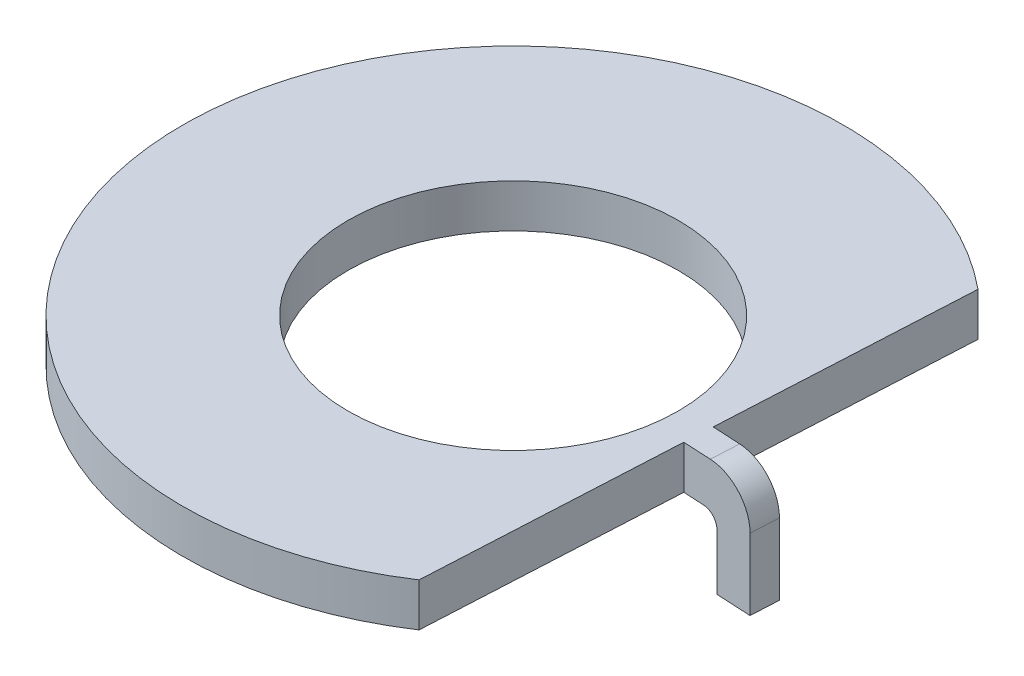
ISO-10303-21;
HEADER;
FILE_DESCRIPTION(('STEP AP214'),'2;1');
FILE_NAME('part.step','',(''),(''),'','','');
FILE_SCHEMA(('AUTOMOTIVE_DESIGN { 1 0 10303 214 1 1 1 1 }'));
ENDSEC;
DATA;
#1=APPLICATION_CONTEXT('core data for automotive mechanical design processes');
#2=APPLICATION_PROTOCOL_DEFINITION('international standard','automotive_design',2000,#1);
#3=PRODUCT_CONTEXT('',#1,'mechanical');
#4=PRODUCT('Part','Part','',(#3));
#5=PRODUCT_RELATED_PRODUCT_CATEGORY('part','',(#4));
#6=PRODUCT_DEFINITION_FORMATION('','',#4);
#7=PRODUCT_DEFINITION_CONTEXT('part definition',#1,'design');
#8=PRODUCT_DEFINITION('design','',#6,#7);
#9=PRODUCT_DEFINITION_SHAPE('','',#8);
#10=(LENGTH_UNIT() NAMED_UNIT(*) SI_UNIT(.MILLI.,.METRE.));
#11=(NAMED_UNIT(*) PLANE_ANGLE_UNIT() SI_UNIT($,.RADIAN.));
#12=(NAMED_UNIT(*) SI_UNIT($,.STERADIAN.) SOLID_ANGLE_UNIT());
#13=UNCERTAINTY_MEASURE_WITH_UNIT(LENGTH_MEASURE(1.E-05),#10,'distance_accuracy_value','');
#14=(GEOMETRIC_REPRESENTATION_CONTEXT(3) GLOBAL_UNCERTAINTY_ASSIGNED_CONTEXT((#13)) GLOBAL_UNIT_ASSIGNED_CONTEXT((#10,
#11,#12)) REPRESENTATION_CONTEXT('',''));
#15=CARTESIAN_POINT('',(0.,0.,0.));
#16=DIRECTION('',(0.,0.,1.));
#17=DIRECTION('',(1.,0.,0.));
#18=AXIS2_PLACEMENT_3D('',#15,#16,#17);
#19=CARTESIAN_POINT('',(3.29856729412844,0.7874,5.00522578572697));
#20=DIRECTION('',(-0.998629534754574,0.,-0.0523359562429439));
#21=DIRECTION('',(-0.0523359562429439,0.,0.998629534754574));
#22=AXIS2_PLACEMENT_3D('',#19,#20,#21);
#23=PLANE('',#22);
#24=DIRECTION('',(0.,1.,0.));
#25=VECTOR('',#24,1.);
#26=CARTESIAN_POINT('',(3.53783329270156,0.,0.43975856222757));
#27=LINE('',#26,#25);
#28=CARTESIAN_POINT('',(3.53783329270156,0.,0.43975856222757));
#29=VERTEX_POINT('',#28);
#30=CARTESIAN_POINT('',(3.53783329270156,0.7874,0.43975856222757));
#31=VERTEX_POINT('',#30);
#32=EDGE_CURVE('E39',#29,#31,#27,.T.);
#33=ORIENTED_EDGE('',*,*,#32,.T.);
#34=DIRECTION('',(0.0523359562429439,0.,-0.998629534754574));
#35=VECTOR('',#34,1.);
#36=CARTESIAN_POINT('',(3.29856729412844,0.7874,5.00522578572697));
#37=LINE('',#36,#35);
#38=CARTESIAN_POINT('',(3.29856729412844,0.7874,5.00522578572697));
#39=VERTEX_POINT('',#38);
#40=EDGE_CURVE('E128',#39,#31,#37,.T.);
#41=ORIENTED_EDGE('',*,*,#40,.F.);
#42=DIRECTION('',(0.,-1.,0.));
#43=VECTOR('',#42,1.);
#44=CARTESIAN_POINT('',(3.29856729412844,0.7874,5.00522578572697));
#45=LINE('',#44,#43);
#46=CARTESIAN_POINT('',(3.29856729412844,0.,5.00522578572697));
#47=VERTEX_POINT('',#46);
#48=EDGE_CURVE('E24',#39,#47,#45,.T.);
#49=ORIENTED_EDGE('',*,*,#48,.T.);
#50=DIRECTION('',(0.0523359562429439,0.,-0.998629534754574));
#51=VECTOR('',#50,1.);
#52=CARTESIAN_POINT('',(3.29856729412844,0.,5.00522578572697));
#53=LINE('',#52,#51);
#54=EDGE_CURVE('E122',#47,#29,#53,.T.);
#55=ORIENTED_EDGE('',*,*,#54,.T.);
#56=EDGE_LOOP('',(#33,#41,#49,#55));
#57=FACE_BOUND('',#56,.T.);
#58=ADVANCED_FACE('F16',(#57),#23,.F.);
#59=CARTESIAN_POINT('',(3.56441995847297,0.7874,-0.0675452414277527));
#60=VERTEX_POINT('',#59);
#61=CARTESIAN_POINT('',(3.80368595704609,0.7874,-4.63301246492715));
#62=VERTEX_POINT('',#61);
#63=EDGE_CURVE('E31',#60,#62,#37,.T.);
#64=ORIENTED_EDGE('',*,*,#63,.F.);
#65=DIRECTION('',(0.,1.,0.));
#66=VECTOR('',#65,1.);
#67=CARTESIAN_POINT('',(3.56441995847297,0.,-0.0675452414277531));
#68=LINE('',#67,#66);
#69=CARTESIAN_POINT('',(3.56441995847297,0.,-0.0675452414277531));
#70=VERTEX_POINT('',#69);
#71=EDGE_CURVE('E190',#70,#60,#68,.T.);
#72=ORIENTED_EDGE('',*,*,#71,.F.);
#73=CARTESIAN_POINT('',(3.80368595704609,0.,-4.63301246492715));
#74=VERTEX_POINT('',#73);
#75=EDGE_CURVE('E120',#70,#74,#53,.T.);
#76=ORIENTED_EDGE('',*,*,#75,.T.);
#77=DIRECTION('',(0.,-1.,0.));
#78=VECTOR('',#77,1.);
#79=CARTESIAN_POINT('',(3.80368595704609,0.7874,-4.63301246492715));
#80=LINE('',#79,#78);
#81=EDGE_CURVE('E11',#62,#74,#80,.T.);
#82=ORIENTED_EDGE('',*,*,#81,.F.);
#83=EDGE_LOOP('',(#64,#72,#76,#82));
#84=FACE_BOUND('',#83,.T.);
#85=ADVANCED_FACE('F18',(#84),#23,.F.);
#86=CARTESIAN_POINT('',(0.,0.7874,0.));
#87=DIRECTION('',(0.,-1.,0.));
#88=DIRECTION('',(0.,0.,-1.));
#89=AXIS2_PLACEMENT_3D('',#86,#87,#88);
#90=CYLINDRICAL_SURFACE('',#89,2.9972);
#91=CARTESIAN_POINT('',(0.,0.7874,0.));
#92=DIRECTION('',(0.,1.,0.));
#93=DIRECTION('',(1.,0.,0.));
#94=AXIS2_PLACEMENT_3D('',#91,#92,#93);
#95=CIRCLE('',#94,2.9972);
#96=CARTESIAN_POINT('',(2.9972,0.7874,0.));
#97=VERTEX_POINT('',#96);
#98=EDGE_CURVE('E132',#97,#97,#95,.T.);
#99=ORIENTED_EDGE('',*,*,#98,.T.);
#100=EDGE_LOOP('',(#99));
#101=FACE_BOUND('',#100,.T.);
#102=CARTESIAN_POINT('',(0.,0.,0.));
#103=DIRECTION('',(0.,1.,0.));
#104=DIRECTION('',(1.,0.,0.));
#105=AXIS2_PLACEMENT_3D('',#102,#103,#104);
#106=CIRCLE('',#105,2.9972);
#107=CARTESIAN_POINT('',(2.9972,0.,0.));
#108=VERTEX_POINT('',#107);
#109=EDGE_CURVE('E137',#108,#108,#106,.T.);
#110=ORIENTED_EDGE('',*,*,#109,.F.);
#111=EDGE_LOOP('',(#110));
#112=FACE_BOUND('',#111,.T.);
#113=ADVANCED_FACE('F198',(#101,#112),#90,.F.);
#114=CARTESIAN_POINT('',(0.,0.7874,0.));
#115=DIRECTION('',(0.,-1.,0.));
#116=DIRECTION('',(0.,0.,-1.));
#117=AXIS2_PLACEMENT_3D('',#114,#115,#116);
#118=CYLINDRICAL_SURFACE('',#117,5.9944);
#119=CARTESIAN_POINT('',(0.,0.,0.));
#120=DIRECTION('',(0.,1.,0.));
#121=DIRECTION('',(1.,0.,0.));
#122=AXIS2_PLACEMENT_3D('',#119,#120,#121);
#123=CIRCLE('',#122,5.9944);
#124=EDGE_CURVE('E135',#74,#47,#123,.T.);
#125=ORIENTED_EDGE('',*,*,#124,.T.);
#126=ORIENTED_EDGE('',*,*,#48,.F.);
#127=CARTESIAN_POINT('',(0.,0.7874,0.));
#128=DIRECTION('',(0.,1.,0.));
#129=DIRECTION('',(1.,0.,0.));
#130=AXIS2_PLACEMENT_3D('',#127,#128,#129);
#131=CIRCLE('',#130,5.9944);
#132=EDGE_CURVE('E130',#62,#39,#131,.T.);
#133=ORIENTED_EDGE('',*,*,#132,.F.);
#134=ORIENTED_EDGE('',*,*,#81,.T.);
#135=EDGE_LOOP('',(#125,#126,#133,#134));
#136=FACE_BOUND('',#135,.T.);
#137=ADVANCED_FACE('F204',(#136),#118,.T.);
#138=CARTESIAN_POINT('',(0.,0.7874,0.));
#139=DIRECTION('',(0.,1.,0.));
#140=DIRECTION('',(0.,0.,1.));
#141=AXIS2_PLACEMENT_3D('',#138,#139,#140);
#142=PLANE('',#141);
#143=ORIENTED_EDGE('',*,*,#98,.F.);
#144=EDGE_LOOP('',(#143));
#145=FACE_BOUND('',#144,.T.);
#146=ORIENTED_EDGE('',*,*,#40,.T.);
#147=DIRECTION('',(0.998629534754574,0.,0.0523359562429439));
#148=VECTOR('',#147,1.);
#149=CARTESIAN_POINT('',(3.53783329270156,0.7874,0.43975856222757));
#150=LINE('',#149,#148);
#151=CARTESIAN_POINT('',(4.04513709635688,0.7874,0.466345227998986));
#152=VERTEX_POINT('',#151);
#153=EDGE_CURVE('E160',#31,#152,#150,.T.);
#154=ORIENTED_EDGE('',*,*,#153,.T.);
#155=DIRECTION('',(-0.0523359562429439,0.,0.998629534754574));
#156=VECTOR('',#155,1.);
#157=CARTESIAN_POINT('',(4.0717237621283,0.7874,-0.0409585756563376));
#158=LINE('',#157,#156);
#159=CARTESIAN_POINT('',(4.0717237621283,0.7874,-0.0409585756563376));
#160=VERTEX_POINT('',#159);
#161=EDGE_CURVE('E168',#160,#152,#158,.T.);
#162=ORIENTED_EDGE('',*,*,#161,.F.);
#163=DIRECTION('',(0.998629534754574,0.,0.0523359562429439));
#164=VECTOR('',#163,1.);
#165=CARTESIAN_POINT('',(3.56441995847297,0.7874,-0.0675452414277531));
#166=LINE('',#165,#164);
#167=EDGE_CURVE('E188',#60,#160,#166,.T.);
#168=ORIENTED_EDGE('',*,*,#167,.F.);
#169=ORIENTED_EDGE('',*,*,#63,.T.);
#170=ORIENTED_EDGE('',*,*,#132,.T.);
#171=EDGE_LOOP('',(#146,#154,#162,#168,#169,#170));
#172=FACE_BOUND('',#171,.T.);
#173=ADVANCED_FACE('F233',(#145,#172),#142,.T.);
#174=CARTESIAN_POINT('',(0.,0.,0.));
#175=DIRECTION('',(0.,1.,0.));
#176=DIRECTION('',(0.,0.,1.));
#177=AXIS2_PLACEMENT_3D('',#174,#175,#176);
#178=PLANE('',#177);
#179=ORIENTED_EDGE('',*,*,#109,.T.);
#180=EDGE_LOOP('',(#179));
#181=FACE_BOUND('',#180,.T.);
#182=ORIENTED_EDGE('',*,*,#54,.F.);
#183=ORIENTED_EDGE('',*,*,#124,.F.);
#184=ORIENTED_EDGE('',*,*,#75,.F.);
#185=DIRECTION('',(-0.998629534754574,0.,-0.0523359562429439));
#186=VECTOR('',#185,1.);
#187=CARTESIAN_POINT('',(3.94489781121446,0.,-0.0476052420991915));
#188=LINE('',#187,#186);
#189=CARTESIAN_POINT('',(3.94489781121446,0.,-0.0476052420991915));
#190=VERTEX_POINT('',#189);
#191=EDGE_CURVE('E192',#190,#70,#188,.T.);
#192=ORIENTED_EDGE('',*,*,#191,.F.);
#193=DIRECTION('',(-0.0523359562429439,0.,0.998629534754574));
#194=VECTOR('',#193,1.);
#195=CARTESIAN_POINT('',(3.94489781121446,0.,-0.0476052420991915));
#196=LINE('',#195,#194);
#197=CARTESIAN_POINT('',(3.91831114544305,0.,0.459698561556132));
#198=VERTEX_POINT('',#197);
#199=EDGE_CURVE('E151',#190,#198,#196,.T.);
#200=ORIENTED_EDGE('',*,*,#199,.T.);
#201=DIRECTION('',(-0.998629534754574,0.,-0.0523359562429439));
#202=VECTOR('',#201,1.);
#203=CARTESIAN_POINT('',(3.91831114544305,0.,0.459698561556132));
#204=LINE('',#203,#202);
#205=EDGE_CURVE('E149',#198,#29,#204,.T.);
#206=ORIENTED_EDGE('',*,*,#205,.T.);
#207=EDGE_LOOP('',(#182,#183,#184,#192,#200,#206));
#208=FACE_BOUND('',#207,.T.);
#209=ADVANCED_FACE('F147',(#181,#208),#178,.F.);
#210=CARTESIAN_POINT('',(4.83267946761128,0.0254000000000001,-0.00107857699921431));
#211=DIRECTION('',(-0.998629534754574,0.,-0.0523359562429439));
#212=DIRECTION('',(-0.0523359562429439,0.,0.998629534754574));
#213=AXIS2_PLACEMENT_3D('',#210,#211,#212);
#214=PLANE('',#213);
#215=DIRECTION('',(0.,-1.,0.));
#216=VECTOR('',#215,1.);
#217=CARTESIAN_POINT('',(4.80609280183987,0.0254000000000001,0.506225226656109));
#218=LINE('',#217,#216);
#219=CARTESIAN_POINT('',(4.80609280183987,0.0254000000000002,0.506225226656109));
#220=VERTEX_POINT('',#219);
#221=CARTESIAN_POINT('',(4.80609280183987,-1.27,0.506225226656109));
#222=VERTEX_POINT('',#221);
#223=EDGE_CURVE('E119',#220,#222,#218,.T.);
#224=ORIENTED_EDGE('',*,*,#223,.T.);
#225=DIRECTION('',(-0.0523359562429439,0.,0.998629534754574));
#226=VECTOR('',#225,1.);
#227=CARTESIAN_POINT('',(4.83267946761128,-1.27,-0.00107857699921431));
#228=LINE('',#227,#226);
#229=CARTESIAN_POINT('',(4.83267946761128,-1.27,-0.00107857699921431));
#230=VERTEX_POINT('',#229);
#231=EDGE_CURVE('E99',#230,#222,#228,.T.);
#232=ORIENTED_EDGE('',*,*,#231,.F.);
#233=DIRECTION('',(0.,-1.,0.));
#234=VECTOR('',#233,1.);
#235=CARTESIAN_POINT('',(4.83267946761128,0.0254000000000001,-0.00107857699921431));
#236=LINE('',#235,#234);
#237=CARTESIAN_POINT('',(4.83267946761128,0.0254000000000002,-0.00107857699921431));
#238=VERTEX_POINT('',#237);
#239=EDGE_CURVE('E106',#238,#230,#236,.T.);
#240=ORIENTED_EDGE('',*,*,#239,.F.);
#241=DIRECTION('',(-0.0523359562429439,0.,0.998629534754574));
#242=VECTOR('',#241,1.);
#243=CARTESIAN_POINT('',(4.83267946761128,0.0254000000000002,-0.00107857699921431));
#244=LINE('',#243,#242);
#245=EDGE_CURVE('E166',#238,#220,#244,.T.);
#246=ORIENTED_EDGE('',*,*,#245,.T.);
#247=EDGE_LOOP('',(#224,#232,#240,#246));
#248=FACE_BOUND('',#247,.T.);
#249=ADVANCED_FACE('F117',(#248),#214,.F.);
#250=CARTESIAN_POINT('',(4.83267946761128,-1.27,-0.00107857699921431));
#251=DIRECTION('',(0.,1.,0.));
#252=DIRECTION('',(0.,0.,1.));
#253=AXIS2_PLACEMENT_3D('',#250,#251,#252);
#254=PLANE('',#253);
#255=DIRECTION('',(-0.998629534754574,0.,-0.0523359562429439));
#256=VECTOR('',#255,1.);
#257=CARTESIAN_POINT('',(4.80609280183987,-1.27,0.506225226656109));
#258=LINE('',#257,#256);
#259=CARTESIAN_POINT('',(4.17196304727071,-1.27,0.47299189444184));
#260=VERTEX_POINT('',#259);
#261=EDGE_CURVE('E182',#222,#260,#258,.T.);
#262=ORIENTED_EDGE('',*,*,#261,.T.);
#263=DIRECTION('',(-0.0523359562429439,0.,0.998629534754574));
#264=VECTOR('',#263,1.);
#265=CARTESIAN_POINT('',(4.19854971304213,-1.27,-0.0343119092134837));
#266=LINE('',#265,#264);
#267=CARTESIAN_POINT('',(4.19854971304213,-1.27,-0.0343119092134837));
#268=VERTEX_POINT('',#267);
#269=EDGE_CURVE('E102',#268,#260,#266,.T.);
#270=ORIENTED_EDGE('',*,*,#269,.F.);
#271=DIRECTION('',(-0.998629534754574,0.,-0.0523359562429439));
#272=VECTOR('',#271,1.);
#273=CARTESIAN_POINT('',(4.83267946761128,-1.27,-0.00107857699921431));
#274=LINE('',#273,#272);
#275=EDGE_CURVE('E95',#230,#268,#274,.T.);
#276=ORIENTED_EDGE('',*,*,#275,.F.);
#277=ORIENTED_EDGE('',*,*,#231,.T.);
#278=EDGE_LOOP('',(#262,#270,#276,#277));
#279=FACE_BOUND('',#278,.T.);
#280=ADVANCED_FACE('F97',(#279),#254,.F.);
#281=CARTESIAN_POINT('',(4.19854971304213,-1.27,-0.0343119092134837));
#282=DIRECTION('',(0.998629534754574,0.,0.0523359562429439));
#283=DIRECTION('',(0.0523359562429439,0.,-0.998629534754574));
#284=AXIS2_PLACEMENT_3D('',#281,#282,#283);
#285=PLANE('',#284);
#286=DIRECTION('',(0.,1.,0.));
#287=VECTOR('',#286,1.);
#288=CARTESIAN_POINT('',(4.17196304727071,-1.27,0.47299189444184));
#289=LINE('',#288,#287);
#290=CARTESIAN_POINT('',(4.17196304727071,-0.254,0.47299189444184));
#291=VERTEX_POINT('',#290);
#292=EDGE_CURVE('E180',#260,#291,#289,.T.);
#293=ORIENTED_EDGE('',*,*,#292,.T.);
#294=DIRECTION('',(-0.0523359562429439,0.,0.998629534754574));
#295=VECTOR('',#294,1.);
#296=CARTESIAN_POINT('',(4.19854971304213,-0.254,-0.0343119092134837));
#297=LINE('',#296,#295);
#298=CARTESIAN_POINT('',(4.19854971304213,-0.254,-0.0343119092134837));
#299=VERTEX_POINT('',#298);
#300=EDGE_CURVE('E124',#299,#291,#297,.T.);
#301=ORIENTED_EDGE('',*,*,#300,.F.);
#302=DIRECTION('',(0.,1.,0.));
#303=VECTOR('',#302,1.);
#304=CARTESIAN_POINT('',(4.19854971304213,-1.27,-0.0343119092134837));
#305=LINE('',#304,#303);
#306=EDGE_CURVE('E105',#268,#299,#305,.T.);
#307=ORIENTED_EDGE('',*,*,#306,.F.);
#308=ORIENTED_EDGE('',*,*,#269,.T.);
#309=EDGE_LOOP('',(#293,#301,#307,#308));
#310=FACE_BOUND('',#309,.T.);
#311=ADVANCED_FACE('F181',(#310),#285,.F.);
#312=CARTESIAN_POINT('',(3.94489781121446,-0.254,-0.0476052420991915));
#313=DIRECTION('',(-0.0523359562429439,0.,0.998629534754574));
#314=DIRECTION('',(0.998629534754574,0.,0.0523359562429439));
#315=AXIS2_PLACEMENT_3D('',#312,#313,#314);
#316=CYLINDRICAL_SURFACE('',#315,0.254);
#317=CARTESIAN_POINT('',(3.91831114544305,-0.254,0.459698561556132));
#318=DIRECTION('',(0.0523359562429439,0.,-0.998629534754574));
#319=DIRECTION('',(-0.998629534754574,0.,-0.0523359562429439));
#320=AXIS2_PLACEMENT_3D('',#317,#318,#319);
#321=CIRCLE('',#320,0.254);
#322=EDGE_CURVE('E155',#198,#291,#321,.T.);
#323=ORIENTED_EDGE('',*,*,#322,.F.);
#324=ORIENTED_EDGE('',*,*,#199,.F.);
#325=CARTESIAN_POINT('',(3.94489781121446,-0.254,-0.0476052420991915));
#326=DIRECTION('',(0.0523359562429439,0.,-0.998629534754574));
#327=DIRECTION('',(-0.998629534754574,0.,-0.0523359562429439));
#328=AXIS2_PLACEMENT_3D('',#325,#326,#327);
#329=CIRCLE('',#328,0.254);
#330=EDGE_CURVE('E177',#190,#299,#329,.T.);
#331=ORIENTED_EDGE('',*,*,#330,.T.);
#332=ORIENTED_EDGE('',*,*,#300,.T.);
#333=EDGE_LOOP('',(#323,#324,#331,#332));
#334=FACE_BOUND('',#333,.T.);
#335=ADVANCED_FACE('F175',(#334),#316,.F.);
#336=CARTESIAN_POINT('',(4.0717237621283,0.0254000000000001,-0.0409585756563376));
#337=DIRECTION('',(-0.0523359562429439,0.,0.998629534754574));
#338=DIRECTION('',(0.998629534754574,0.,0.0523359562429439));
#339=AXIS2_PLACEMENT_3D('',#336,#337,#338);
#340=CYLINDRICAL_SURFACE('',#339,0.762);
#341=CARTESIAN_POINT('',(4.04513709635688,0.0254000000000001,0.466345227998986));
#342=DIRECTION('',(0.0523359562429439,0.,-0.998629534754574));
#343=DIRECTION('',(-0.998629534754574,0.,-0.0523359562429439));
#344=AXIS2_PLACEMENT_3D('',#341,#342,#343);
#345=CIRCLE('',#344,0.762);
#346=EDGE_CURVE('E115',#152,#220,#345,.T.);
#347=ORIENTED_EDGE('',*,*,#346,.T.);
#348=ORIENTED_EDGE('',*,*,#245,.F.);
#349=CARTESIAN_POINT('',(4.0717237621283,0.0254000000000001,-0.0409585756563376));
#350=DIRECTION('',(0.0523359562429439,0.,-0.998629534754574));
#351=DIRECTION('',(-0.998629534754574,0.,-0.0523359562429439));
#352=AXIS2_PLACEMENT_3D('',#349,#350,#351);
#353=CIRCLE('',#352,0.762);
#354=EDGE_CURVE('E111',#160,#238,#353,.T.);
#355=ORIENTED_EDGE('',*,*,#354,.F.);
#356=ORIENTED_EDGE('',*,*,#161,.T.);
#357=EDGE_LOOP('',(#347,#348,#355,#356));
#358=FACE_BOUND('',#357,.T.);
#359=ADVANCED_FACE('F283',(#358),#340,.T.);
#360=CARTESIAN_POINT('',(3.94489781121446,-0.254,-0.0476052420991915));
#361=DIRECTION('',(0.0523359562429439,0.,-0.998629534754574));
#362=DIRECTION('',(-0.998629534754574,0.,-0.0523359562429439));
#363=AXIS2_PLACEMENT_3D('',#360,#361,#362);
#364=PLANE('',#363);
#365=ORIENTED_EDGE('',*,*,#239,.T.);
#366=ORIENTED_EDGE('',*,*,#275,.T.);
#367=ORIENTED_EDGE('',*,*,#306,.T.);
#368=ORIENTED_EDGE('',*,*,#330,.F.);
#369=ORIENTED_EDGE('',*,*,#191,.T.);
#370=ORIENTED_EDGE('',*,*,#71,.T.);
#371=ORIENTED_EDGE('',*,*,#167,.T.);
#372=ORIENTED_EDGE('',*,*,#354,.T.);
#373=EDGE_LOOP('',(#365,#366,#367,#368,#369,#370,#371,#372));
#374=FACE_BOUND('',#373,.T.);
#375=ADVANCED_FACE('F109',(#374),#364,.T.);
#376=CARTESIAN_POINT('',(3.91831114544305,-0.254,0.459698561556132));
#377=DIRECTION('',(0.0523359562429439,0.,-0.998629534754574));
#378=DIRECTION('',(-0.998629534754574,0.,-0.0523359562429439));
#379=AXIS2_PLACEMENT_3D('',#376,#377,#378);
#380=PLANE('',#379);
#381=ORIENTED_EDGE('',*,*,#223,.F.);
#382=ORIENTED_EDGE('',*,*,#346,.F.);
#383=ORIENTED_EDGE('',*,*,#153,.F.);
#384=ORIENTED_EDGE('',*,*,#32,.F.);
#385=ORIENTED_EDGE('',*,*,#205,.F.);
#386=ORIENTED_EDGE('',*,*,#322,.T.);
#387=ORIENTED_EDGE('',*,*,#292,.F.);
#388=ORIENTED_EDGE('',*,*,#261,.F.);
#389=EDGE_LOOP('',(#381,#382,#383,#384,#385,#386,#387,#388));
#390=FACE_BOUND('',#389,.T.);
#391=ADVANCED_FACE('F158',(#390),#380,.F.);
#392=CLOSED_SHELL('',(#58,#85,#113,#137,#173,#209,#249,#280,#311,#335,#359,#375,#391));
#393=MANIFOLD_SOLID_BREP('B1',#392);
#394=ADVANCED_BREP_SHAPE_REPRESENTATION('',(#18,#393),#14);
#395=SHAPE_DEFINITION_REPRESENTATION(#9,#394);
ENDSEC;
END-ISO-10303-21;
